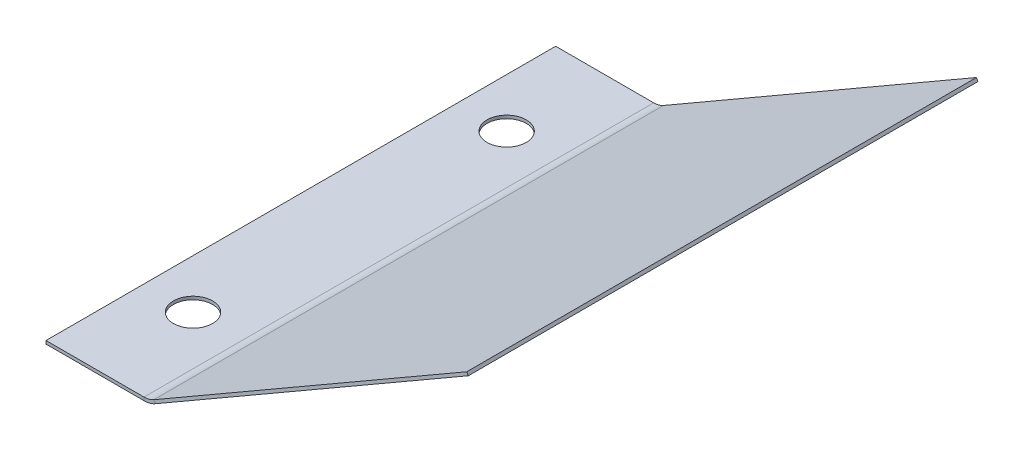
ISO-10303-21;
HEADER;
FILE_DESCRIPTION(('STEP AP214'),'2;1');
FILE_NAME('part.step','',(''),(''),'','','');
FILE_SCHEMA(('AUTOMOTIVE_DESIGN { 1 0 10303 214 1 1 1 1 }'));
ENDSEC;
DATA;
#1=APPLICATION_CONTEXT('core data for automotive mechanical design processes');
#2=APPLICATION_PROTOCOL_DEFINITION('international standard','automotive_design',2000,#1);
#3=PRODUCT_CONTEXT('',#1,'mechanical');
#4=PRODUCT('Part','Part','',(#3));
#5=PRODUCT_RELATED_PRODUCT_CATEGORY('part','',(#4));
#6=PRODUCT_DEFINITION_FORMATION('','',#4);
#7=PRODUCT_DEFINITION_CONTEXT('part definition',#1,'design');
#8=PRODUCT_DEFINITION('design','',#6,#7);
#9=PRODUCT_DEFINITION_SHAPE('','',#8);
#10=(LENGTH_UNIT() NAMED_UNIT(*) SI_UNIT(.MILLI.,.METRE.));
#11=(NAMED_UNIT(*) PLANE_ANGLE_UNIT() SI_UNIT($,.RADIAN.));
#12=(NAMED_UNIT(*) SI_UNIT($,.STERADIAN.) SOLID_ANGLE_UNIT());
#13=UNCERTAINTY_MEASURE_WITH_UNIT(LENGTH_MEASURE(1.E-05),#10,'distance_accuracy_value','');
#14=(GEOMETRIC_REPRESENTATION_CONTEXT(3) GLOBAL_UNCERTAINTY_ASSIGNED_CONTEXT((#13)) GLOBAL_UNIT_ASSIGNED_CONTEXT((#10,
#11,#12)) REPRESENTATION_CONTEXT('',''));
#15=CARTESIAN_POINT('',(0.,0.,0.));
#16=DIRECTION('',(0.,0.,1.));
#17=DIRECTION('',(1.,0.,0.));
#18=AXIS2_PLACEMENT_3D('',#15,#16,#17);
#19=CARTESIAN_POINT('',(0.,0.,0.));
#20=DIRECTION('',(0.,1.,0.));
#21=DIRECTION('',(0.,0.,1.));
#22=AXIS2_PLACEMENT_3D('',#19,#20,#21);
#23=PLANE('',#22);
#24=CARTESIAN_POINT('',(-7.9375,0.,-15.875));
#25=DIRECTION('',(0.,-1.,0.));
#26=DIRECTION('',(0.,0.,-1.));
#27=AXIS2_PLACEMENT_3D('',#24,#25,#26);
#28=CIRCLE('',#27,3.175);
#29=CARTESIAN_POINT('',(-7.9375,0.,-19.05));
#30=VERTEX_POINT('',#29);
#31=EDGE_CURVE('E199',#30,#30,#28,.T.);
#32=ORIENTED_EDGE('',*,*,#31,.F.);
#33=EDGE_LOOP('',(#32));
#34=FACE_BOUND('',#33,.T.);
#35=DIRECTION('',(0.,0.,1.));
#36=VECTOR('',#35,1.);
#37=CARTESIAN_POINT('',(0.,0.,0.));
#38=LINE('',#37,#36);
#39=CARTESIAN_POINT('',(0.,0.,0.));
#40=VERTEX_POINT('',#39);
#41=CARTESIAN_POINT('',(0.,0.,-82.55));
#42=VERTEX_POINT('',#41);
#43=EDGE_CURVE('E131',#40,#42,#38,.F.);
#44=ORIENTED_EDGE('',*,*,#43,.F.);
#45=DIRECTION('',(1.,0.,0.));
#46=VECTOR('',#45,1.);
#47=CARTESIAN_POINT('',(0.,0.,0.));
#48=LINE('',#47,#46);
#49=CARTESIAN_POINT('',(-15.875,0.,0.));
#50=VERTEX_POINT('',#49);
#51=EDGE_CURVE('E135',#50,#40,#48,.T.);
#52=ORIENTED_EDGE('',*,*,#51,.F.);
#53=DIRECTION('',(0.,0.,1.));
#54=VECTOR('',#53,1.);
#55=CARTESIAN_POINT('',(-15.875,0.,0.));
#56=LINE('',#55,#54);
#57=CARTESIAN_POINT('',(-15.875,0.,-82.55));
#58=VERTEX_POINT('',#57);
#59=EDGE_CURVE('E137',#58,#50,#56,.T.);
#60=ORIENTED_EDGE('',*,*,#59,.F.);
#61=DIRECTION('',(1.,0.,0.));
#62=VECTOR('',#61,1.);
#63=CARTESIAN_POINT('',(0.,0.,-82.55));
#64=LINE('',#63,#62);
#65=EDGE_CURVE('E99',#42,#58,#64,.F.);
#66=ORIENTED_EDGE('',*,*,#65,.F.);
#67=EDGE_LOOP('',(#44,#52,#60,#66));
#68=FACE_BOUND('',#67,.T.);
#69=CARTESIAN_POINT('',(-7.9375,0.,-66.675));
#70=DIRECTION('',(0.,-1.,0.));
#71=DIRECTION('',(0.,0.,-1.));
#72=AXIS2_PLACEMENT_3D('',#69,#70,#71);
#73=CIRCLE('',#72,3.175);
#74=CARTESIAN_POINT('',(-7.9375,0.,-69.85));
#75=VERTEX_POINT('',#74);
#76=EDGE_CURVE('E205',#75,#75,#73,.T.);
#77=ORIENTED_EDGE('',*,*,#76,.F.);
#78=EDGE_LOOP('',(#77));
#79=FACE_BOUND('',#78,.T.);
#80=ADVANCED_FACE('F58',(#34,#68,#79),#23,.F.);
#81=CARTESIAN_POINT('',(-15.875,0.508,0.));
#82=DIRECTION('',(-1.,0.,0.));
#83=DIRECTION('',(0.,0.,1.));
#84=AXIS2_PLACEMENT_3D('',#81,#82,#83);
#85=PLANE('',#84);
#86=DIRECTION('',(0.,1.,0.));
#87=VECTOR('',#86,1.);
#88=CARTESIAN_POINT('',(-15.875,0.508,-82.55));
#89=LINE('',#88,#87);
#90=CARTESIAN_POINT('',(-15.875,0.508,-82.55));
#91=VERTEX_POINT('',#90);
#92=EDGE_CURVE('E13',#58,#91,#89,.T.);
#93=ORIENTED_EDGE('',*,*,#92,.F.);
#94=ORIENTED_EDGE('',*,*,#59,.T.);
#95=DIRECTION('',(0.,1.,0.));
#96=VECTOR('',#95,1.);
#97=CARTESIAN_POINT('',(-15.875,0.508,0.));
#98=LINE('',#97,#96);
#99=CARTESIAN_POINT('',(-15.875,0.508,0.));
#100=VERTEX_POINT('',#99);
#101=EDGE_CURVE('E68',#50,#100,#98,.T.);
#102=ORIENTED_EDGE('',*,*,#101,.T.);
#103=DIRECTION('',(0.,0.,1.));
#104=VECTOR('',#103,1.);
#105=CARTESIAN_POINT('',(-15.875,0.508,0.));
#106=LINE('',#105,#104);
#107=EDGE_CURVE('E121',#91,#100,#106,.T.);
#108=ORIENTED_EDGE('',*,*,#107,.F.);
#109=EDGE_LOOP('',(#93,#94,#102,#108));
#110=FACE_BOUND('',#109,.T.);
#111=ADVANCED_FACE('F125',(#110),#85,.T.);
#112=CARTESIAN_POINT('',(0.,0.508,0.));
#113=DIRECTION('',(0.,0.,1.));
#114=DIRECTION('',(1.,0.,0.));
#115=AXIS2_PLACEMENT_3D('',#112,#113,#114);
#116=PLANE('',#115);
#117=ORIENTED_EDGE('',*,*,#101,.F.);
#118=ORIENTED_EDGE('',*,*,#51,.T.);
#119=DIRECTION('',(0.,1.,0.));
#120=VECTOR('',#119,1.);
#121=CARTESIAN_POINT('',(0.,0.508,0.));
#122=LINE('',#121,#120);
#123=CARTESIAN_POINT('',(0.,0.508,0.));
#124=VERTEX_POINT('',#123);
#125=EDGE_CURVE('E76',#40,#124,#122,.T.);
#126=ORIENTED_EDGE('',*,*,#125,.T.);
#127=DIRECTION('',(1.,0.,0.));
#128=VECTOR('',#127,1.);
#129=CARTESIAN_POINT('',(0.,0.508,0.));
#130=LINE('',#129,#128);
#131=EDGE_CURVE('E126',#100,#124,#130,.T.);
#132=ORIENTED_EDGE('',*,*,#131,.F.);
#133=EDGE_LOOP('',(#117,#118,#126,#132));
#134=FACE_BOUND('',#133,.T.);
#135=ADVANCED_FACE('F218',(#134),#116,.T.);
#136=CARTESIAN_POINT('',(0.,0.508,-82.55));
#137=DIRECTION('',(0.,0.,-1.));
#138=DIRECTION('',(-1.,0.,0.));
#139=AXIS2_PLACEMENT_3D('',#136,#137,#138);
#140=PLANE('',#139);
#141=ORIENTED_EDGE('',*,*,#65,.T.);
#142=ORIENTED_EDGE('',*,*,#92,.T.);
#143=DIRECTION('',(-1.,0.,0.));
#144=VECTOR('',#143,1.);
#145=CARTESIAN_POINT('',(0.,0.508,-82.55));
#146=LINE('',#145,#144);
#147=CARTESIAN_POINT('',(0.,0.508,-82.55));
#148=VERTEX_POINT('',#147);
#149=EDGE_CURVE('E116',#148,#91,#146,.T.);
#150=ORIENTED_EDGE('',*,*,#149,.F.);
#151=DIRECTION('',(0.,1.,0.));
#152=VECTOR('',#151,1.);
#153=CARTESIAN_POINT('',(0.,0.508,-82.55));
#154=LINE('',#153,#152);
#155=EDGE_CURVE('E62',#42,#148,#154,.T.);
#156=ORIENTED_EDGE('',*,*,#155,.F.);
#157=EDGE_LOOP('',(#141,#142,#150,#156));
#158=FACE_BOUND('',#157,.T.);
#159=ADVANCED_FACE('F60',(#158),#140,.T.);
#160=CARTESIAN_POINT('',(0.,0.508,0.));
#161=DIRECTION('',(0.,1.,0.));
#162=DIRECTION('',(0.,0.,1.));
#163=AXIS2_PLACEMENT_3D('',#160,#161,#162);
#164=PLANE('',#163);
#165=CARTESIAN_POINT('',(-7.9375,0.508,-66.675));
#166=DIRECTION('',(0.,1.,0.));
#167=DIRECTION('',(0.,0.,1.));
#168=AXIS2_PLACEMENT_3D('',#165,#166,#167);
#169=CIRCLE('',#168,3.175);
#170=CARTESIAN_POINT('',(-7.9375,0.508,-63.5));
#171=VERTEX_POINT('',#170);
#172=EDGE_CURVE('E202',#171,#171,#169,.T.);
#173=ORIENTED_EDGE('',*,*,#172,.F.);
#174=EDGE_LOOP('',(#173));
#175=FACE_BOUND('',#174,.T.);
#176=CARTESIAN_POINT('',(-7.9375,0.508,-15.875));
#177=DIRECTION('',(0.,1.,0.));
#178=DIRECTION('',(0.,0.,1.));
#179=AXIS2_PLACEMENT_3D('',#176,#177,#178);
#180=CIRCLE('',#179,3.175);
#181=CARTESIAN_POINT('',(-7.9375,0.508,-12.7));
#182=VERTEX_POINT('',#181);
#183=EDGE_CURVE('E171',#182,#182,#180,.T.);
#184=ORIENTED_EDGE('',*,*,#183,.F.);
#185=EDGE_LOOP('',(#184));
#186=FACE_BOUND('',#185,.T.);
#187=DIRECTION('',(0.,0.,-1.));
#188=VECTOR('',#187,1.);
#189=CARTESIAN_POINT('',(0.,0.508,0.));
#190=LINE('',#189,#188);
#191=EDGE_CURVE('E123',#124,#148,#190,.T.);
#192=ORIENTED_EDGE('',*,*,#191,.T.);
#193=ORIENTED_EDGE('',*,*,#149,.T.);
#194=ORIENTED_EDGE('',*,*,#107,.T.);
#195=ORIENTED_EDGE('',*,*,#131,.T.);
#196=EDGE_LOOP('',(#192,#193,#194,#195));
#197=FACE_BOUND('',#196,.T.);
#198=ADVANCED_FACE('F120',(#175,#186,#197),#164,.T.);
#199=CARTESIAN_POINT('',(0.,3.683,0.));
#200=DIRECTION('',(0.,0.,1.));
#201=DIRECTION('',(1.,0.,0.));
#202=AXIS2_PLACEMENT_3D('',#199,#200,#201);
#203=PLANE('',#202);
#204=DIRECTION('',(-0.499999999999995,0.866025403784442,0.));
#205=VECTOR('',#204,1.);
#206=CARTESIAN_POINT('',(1.84149999999998,0.493428437861902,0.));
#207=LINE('',#206,#205);
#208=CARTESIAN_POINT('',(1.58749999999998,0.933369342984399,0.));
#209=VERTEX_POINT('',#208);
#210=CARTESIAN_POINT('',(1.84149999999998,0.493428437861903,0.));
#211=VERTEX_POINT('',#210);
#212=EDGE_CURVE('E168',#209,#211,#207,.F.);
#213=ORIENTED_EDGE('',*,*,#212,.F.);
#214=CARTESIAN_POINT('',(0.,3.683,0.));
#215=DIRECTION('',(0.,0.,-1.));
#216=DIRECTION('',(-1.,0.,0.));
#217=AXIS2_PLACEMENT_3D('',#214,#215,#216);
#218=CIRCLE('',#217,3.175);
#219=EDGE_CURVE('E157',#124,#209,#218,.F.);
#220=ORIENTED_EDGE('',*,*,#219,.F.);
#221=ORIENTED_EDGE('',*,*,#125,.F.);
#222=CARTESIAN_POINT('',(0.,3.683,0.));
#223=DIRECTION('',(0.,0.,-1.));
#224=DIRECTION('',(-1.,0.,0.));
#225=AXIS2_PLACEMENT_3D('',#222,#223,#224);
#226=CIRCLE('',#225,3.683);
#227=EDGE_CURVE('E134',#40,#211,#226,.F.);
#228=ORIENTED_EDGE('',*,*,#227,.T.);
#229=EDGE_LOOP('',(#213,#220,#221,#228));
#230=FACE_BOUND('',#229,.T.);
#231=ADVANCED_FACE('F230',(#230),#203,.T.);
#232=CARTESIAN_POINT('',(0.,3.683,-82.55));
#233=DIRECTION('',(0.,0.,1.));
#234=DIRECTION('',(1.,0.,0.));
#235=AXIS2_PLACEMENT_3D('',#232,#233,#234);
#236=PLANE('',#235);
#237=CARTESIAN_POINT('',(0.,3.683,-82.55));
#238=DIRECTION('',(0.,0.,-1.));
#239=DIRECTION('',(-1.,0.,0.));
#240=AXIS2_PLACEMENT_3D('',#237,#238,#239);
#241=CIRCLE('',#240,3.175);
#242=CARTESIAN_POINT('',(1.58749999999998,0.933369342984399,-82.55));
#243=VERTEX_POINT('',#242);
#244=EDGE_CURVE('E147',#243,#148,#241,.T.);
#245=ORIENTED_EDGE('',*,*,#244,.F.);
#246=DIRECTION('',(-0.499999999999995,0.866025403784442,0.));
#247=VECTOR('',#246,1.);
#248=CARTESIAN_POINT('',(1.58749999999998,0.933369342984398,-82.55));
#249=LINE('',#248,#247);
#250=CARTESIAN_POINT('',(1.84149999999998,0.493428437861903,-82.55));
#251=VERTEX_POINT('',#250);
#252=EDGE_CURVE('E173',#243,#251,#249,.F.);
#253=ORIENTED_EDGE('',*,*,#252,.T.);
#254=CARTESIAN_POINT('',(0.,3.683,-82.55));
#255=DIRECTION('',(0.,0.,-1.));
#256=DIRECTION('',(-1.,0.,0.));
#257=AXIS2_PLACEMENT_3D('',#254,#255,#256);
#258=CIRCLE('',#257,3.683);
#259=EDGE_CURVE('E150',#251,#42,#258,.T.);
#260=ORIENTED_EDGE('',*,*,#259,.T.);
#261=ORIENTED_EDGE('',*,*,#155,.T.);
#262=EDGE_LOOP('',(#245,#253,#260,#261));
#263=FACE_BOUND('',#262,.T.);
#264=ADVANCED_FACE('F145',(#263),#236,.F.);
#265=CARTESIAN_POINT('',(0.,3.683,-82.55));
#266=DIRECTION('',(0.,0.,-1.));
#267=DIRECTION('',(0.499999999999995,-0.866025403784442,0.));
#268=AXIS2_PLACEMENT_3D('',#265,#266,#267);
#269=CYLINDRICAL_SURFACE('',#268,3.683);
#270=ORIENTED_EDGE('',*,*,#43,.T.);
#271=ORIENTED_EDGE('',*,*,#259,.F.);
#272=DIRECTION('',(0.,0.,-1.));
#273=VECTOR('',#272,1.);
#274=CARTESIAN_POINT('',(1.84149999999998,0.493428437861903,0.));
#275=LINE('',#274,#273);
#276=EDGE_CURVE('E175',#251,#211,#275,.F.);
#277=ORIENTED_EDGE('',*,*,#276,.T.);
#278=ORIENTED_EDGE('',*,*,#227,.F.);
#279=EDGE_LOOP('',(#270,#271,#277,#278));
#280=FACE_BOUND('',#279,.T.);
#281=ADVANCED_FACE('F270',(#280),#269,.T.);
#282=CARTESIAN_POINT('',(0.,3.683,-82.55));
#283=DIRECTION('',(0.,0.,-1.));
#284=DIRECTION('',(0.499999999999995,-0.866025403784442,0.));
#285=AXIS2_PLACEMENT_3D('',#282,#283,#284);
#286=CYLINDRICAL_SURFACE('',#285,3.175);
#287=ORIENTED_EDGE('',*,*,#191,.F.);
#288=ORIENTED_EDGE('',*,*,#219,.T.);
#289=DIRECTION('',(0.,0.,-1.));
#290=VECTOR('',#289,1.);
#291=CARTESIAN_POINT('',(1.58749999999998,0.933369342984399,0.));
#292=LINE('',#291,#290);
#293=EDGE_CURVE('E156',#209,#243,#292,.T.);
#294=ORIENTED_EDGE('',*,*,#293,.T.);
#295=ORIENTED_EDGE('',*,*,#244,.T.);
#296=EDGE_LOOP('',(#287,#288,#294,#295));
#297=FACE_BOUND('',#296,.T.);
#298=ADVANCED_FACE('F152',(#297),#286,.F.);
#299=CARTESIAN_POINT('',(52.52965105619,29.7582460948772,-82.55));
#300=DIRECTION('',(0.,0.,1.));
#301=DIRECTION('',(1.,0.,0.));
#302=AXIS2_PLACEMENT_3D('',#299,#300,#301);
#303=PLANE('',#302);
#304=ORIENTED_EDGE('',*,*,#252,.F.);
#305=DIRECTION('',(-0.866025403784442,-0.499999999999995,0.));
#306=VECTOR('',#305,1.);
#307=CARTESIAN_POINT('',(52.27565105619,30.1981869999997,-82.55));
#308=LINE('',#307,#306);
#309=CARTESIAN_POINT('',(52.27565105619,30.1981869999997,-82.55));
#310=VERTEX_POINT('',#309);
#311=EDGE_CURVE('E177',#243,#310,#308,.F.);
#312=ORIENTED_EDGE('',*,*,#311,.T.);
#313=DIRECTION('',(-0.499999999999995,0.866025403784442,0.));
#314=VECTOR('',#313,1.);
#315=CARTESIAN_POINT('',(52.52965105619,29.7582460948772,-82.55));
#316=LINE('',#315,#314);
#317=CARTESIAN_POINT('',(52.52965105619,29.7582460948772,-82.55));
#318=VERTEX_POINT('',#317);
#319=EDGE_CURVE('E158',#318,#310,#316,.T.);
#320=ORIENTED_EDGE('',*,*,#319,.F.);
#321=DIRECTION('',(0.866025403784442,0.499999999999995,0.));
#322=VECTOR('',#321,1.);
#323=CARTESIAN_POINT('',(0.884768233407555,-0.0589409051224926,-82.55));
#324=LINE('',#323,#322);
#325=EDGE_CURVE('E186',#251,#318,#324,.T.);
#326=ORIENTED_EDGE('',*,*,#325,.F.);
#327=EDGE_LOOP('',(#304,#312,#320,#326));
#328=FACE_BOUND('',#327,.T.);
#329=ADVANCED_FACE('F264',(#328),#303,.F.);
#330=CARTESIAN_POINT('',(1.1047386859688,0.0680590948775037,0.));
#331=DIRECTION('',(0.,0.,-1.));
#332=DIRECTION('',(-1.,0.,0.));
#333=AXIS2_PLACEMENT_3D('',#330,#331,#332);
#334=PLANE('',#333);
#335=ORIENTED_EDGE('',*,*,#212,.T.);
#336=DIRECTION('',(-0.866025403784442,-0.499999999999995,0.));
#337=VECTOR('',#336,1.);
#338=CARTESIAN_POINT('',(0.884768233407555,-0.0589409051224926,0.));
#339=LINE('',#338,#337);
#340=CARTESIAN_POINT('',(52.52965105619,29.7582460948772,0.));
#341=VERTEX_POINT('',#340);
#342=EDGE_CURVE('E192',#341,#211,#339,.T.);
#343=ORIENTED_EDGE('',*,*,#342,.F.);
#344=DIRECTION('',(-0.499999999999995,0.866025403784442,0.));
#345=VECTOR('',#344,1.);
#346=CARTESIAN_POINT('',(52.52965105619,29.7582460948772,0.));
#347=LINE('',#346,#345);
#348=CARTESIAN_POINT('',(52.27565105619,30.1981869999997,0.));
#349=VERTEX_POINT('',#348);
#350=EDGE_CURVE('E162',#341,#349,#347,.T.);
#351=ORIENTED_EDGE('',*,*,#350,.T.);
#352=DIRECTION('',(0.866025403784442,0.499999999999995,0.));
#353=VECTOR('',#352,1.);
#354=CARTESIAN_POINT('',(0.850738685968804,0.508000000000001,0.));
#355=LINE('',#354,#353);
#356=EDGE_CURVE('E183',#349,#209,#355,.F.);
#357=ORIENTED_EDGE('',*,*,#356,.T.);
#358=EDGE_LOOP('',(#335,#343,#351,#357));
#359=FACE_BOUND('',#358,.T.);
#360=ADVANCED_FACE('F258',(#359),#334,.F.);
#361=CARTESIAN_POINT('',(0.884768233407555,-0.0589409051224926,0.));
#362=DIRECTION('',(-0.499999999999995,0.866025403784442,0.));
#363=DIRECTION('',(-0.866025403784442,-0.499999999999995,0.));
#364=AXIS2_PLACEMENT_3D('',#361,#362,#363);
#365=PLANE('',#364);
#366=ORIENTED_EDGE('',*,*,#276,.F.);
#367=ORIENTED_EDGE('',*,*,#325,.T.);
#368=DIRECTION('',(0.,0.,1.));
#369=VECTOR('',#368,1.);
#370=CARTESIAN_POINT('',(52.52965105619,29.7582460948772,0.));
#371=LINE('',#370,#369);
#372=EDGE_CURVE('E189',#318,#341,#371,.T.);
#373=ORIENTED_EDGE('',*,*,#372,.T.);
#374=ORIENTED_EDGE('',*,*,#342,.T.);
#375=EDGE_LOOP('',(#366,#367,#373,#374));
#376=FACE_BOUND('',#375,.T.);
#377=ADVANCED_FACE('F255',(#376),#365,.F.);
#378=CARTESIAN_POINT('',(0.630768233407558,0.381000000000004,0.));
#379=DIRECTION('',(-0.499999999999995,0.866025403784442,0.));
#380=DIRECTION('',(-0.866025403784442,-0.499999999999995,0.));
#381=AXIS2_PLACEMENT_3D('',#378,#379,#380);
#382=PLANE('',#381);
#383=ORIENTED_EDGE('',*,*,#311,.F.);
#384=ORIENTED_EDGE('',*,*,#293,.F.);
#385=ORIENTED_EDGE('',*,*,#356,.F.);
#386=DIRECTION('',(0.,0.,-1.));
#387=VECTOR('',#386,1.);
#388=CARTESIAN_POINT('',(52.27565105619,30.1981869999997,0.));
#389=LINE('',#388,#387);
#390=EDGE_CURVE('E180',#310,#349,#389,.F.);
#391=ORIENTED_EDGE('',*,*,#390,.F.);
#392=EDGE_LOOP('',(#383,#384,#385,#391));
#393=FACE_BOUND('',#392,.T.);
#394=ADVANCED_FACE('F251',(#393),#382,.T.);
#395=CARTESIAN_POINT('',(52.52965105619,29.7582460948772,0.));
#396=DIRECTION('',(-0.866025403784442,-0.499999999999995,0.));
#397=DIRECTION('',(0.499999999999995,-0.866025403784442,0.));
#398=AXIS2_PLACEMENT_3D('',#395,#396,#397);
#399=PLANE('',#398);
#400=ORIENTED_EDGE('',*,*,#390,.T.);
#401=ORIENTED_EDGE('',*,*,#350,.F.);
#402=ORIENTED_EDGE('',*,*,#372,.F.);
#403=ORIENTED_EDGE('',*,*,#319,.T.);
#404=EDGE_LOOP('',(#400,#401,#402,#403));
#405=FACE_BOUND('',#404,.T.);
#406=ADVANCED_FACE('F243',(#405),#399,.F.);
#407=CARTESIAN_POINT('',(-7.9375,0.,-15.875));
#408=DIRECTION('',(0.,-1.,0.));
#409=DIRECTION('',(0.,0.,-1.));
#410=AXIS2_PLACEMENT_3D('',#407,#408,#409);
#411=CYLINDRICAL_SURFACE('',#410,3.175);
#412=ORIENTED_EDGE('',*,*,#31,.T.);
#413=EDGE_LOOP('',(#412));
#414=FACE_BOUND('',#413,.T.);
#415=ORIENTED_EDGE('',*,*,#183,.T.);
#416=EDGE_LOOP('',(#415));
#417=FACE_BOUND('',#416,.T.);
#418=ADVANCED_FACE('F241',(#414,#417),#411,.F.);
#419=CARTESIAN_POINT('',(-7.9375,0.,-66.675));
#420=DIRECTION('',(0.,-1.,0.));
#421=DIRECTION('',(0.,0.,-1.));
#422=AXIS2_PLACEMENT_3D('',#419,#420,#421);
#423=CYLINDRICAL_SURFACE('',#422,3.175);
#424=ORIENTED_EDGE('',*,*,#76,.T.);
#425=EDGE_LOOP('',(#424));
#426=FACE_BOUND('',#425,.T.);
#427=ORIENTED_EDGE('',*,*,#172,.T.);
#428=EDGE_LOOP('',(#427));
#429=FACE_BOUND('',#428,.T.);
#430=ADVANCED_FACE('F209',(#426,#429),#423,.F.);
#431=CLOSED_SHELL('',(#80,#111,#135,#159,#198,#231,#264,#281,#298,#329,#360,#377,#394,#406,#418,#430));
#432=MANIFOLD_SOLID_BREP('B2',#431);
#433=ADVANCED_BREP_SHAPE_REPRESENTATION('',(#18,#432),#14);
#434=SHAPE_DEFINITION_REPRESENTATION(#9,#433);
ENDSEC;
END-ISO-10303-21;
